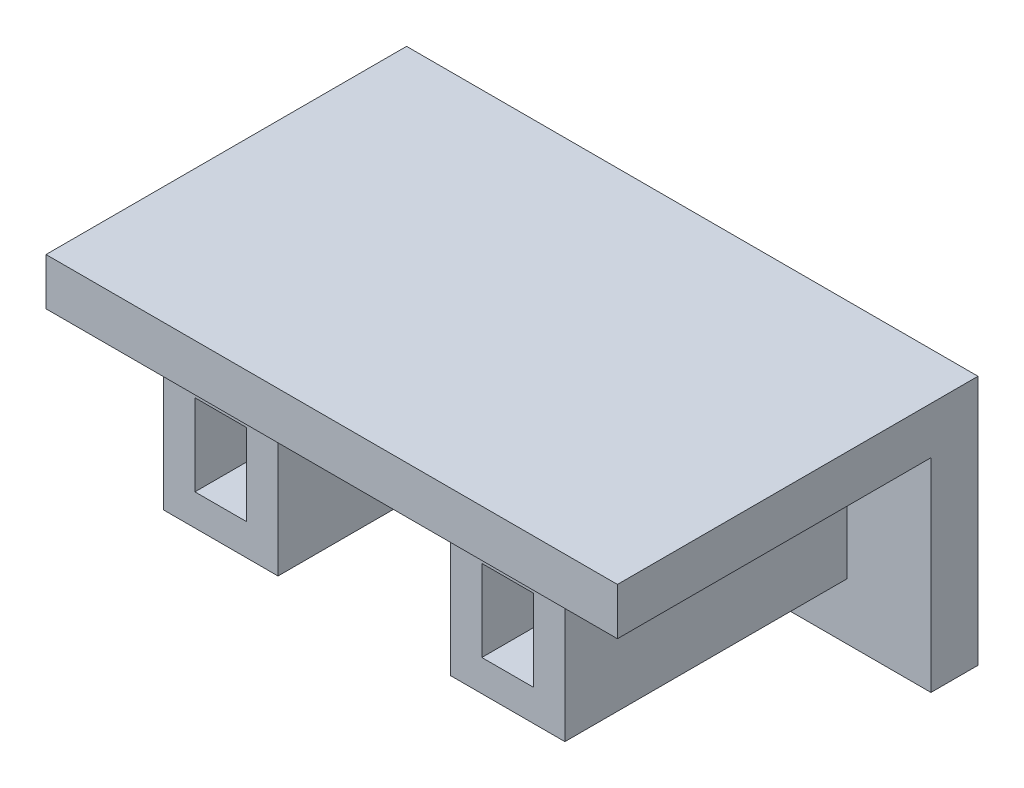
ISO-10303-21;
HEADER;
FILE_DESCRIPTION(('STEP AP214'),'2;1');
FILE_NAME('part.step','',(''),(''),'','','');
FILE_SCHEMA(('AUTOMOTIVE_DESIGN { 1 0 10303 214 1 1 1 1 }'));
ENDSEC;
DATA;
#1=APPLICATION_CONTEXT('core data for automotive mechanical design processes');
#2=APPLICATION_PROTOCOL_DEFINITION('international standard','automotive_design',2000,#1);
#3=PRODUCT_CONTEXT('',#1,'mechanical');
#4=PRODUCT('Part','Part','',(#3));
#5=PRODUCT_RELATED_PRODUCT_CATEGORY('part','',(#4));
#6=PRODUCT_DEFINITION_FORMATION('','',#4);
#7=PRODUCT_DEFINITION_CONTEXT('part definition',#1,'design');
#8=PRODUCT_DEFINITION('design','',#6,#7);
#9=PRODUCT_DEFINITION_SHAPE('','',#8);
#10=(LENGTH_UNIT() NAMED_UNIT(*) SI_UNIT(.MILLI.,.METRE.));
#11=(NAMED_UNIT(*) PLANE_ANGLE_UNIT() SI_UNIT($,.RADIAN.));
#12=(NAMED_UNIT(*) SI_UNIT($,.STERADIAN.) SOLID_ANGLE_UNIT());
#13=UNCERTAINTY_MEASURE_WITH_UNIT(LENGTH_MEASURE(1.E-05),#10,'distance_accuracy_value','');
#14=(GEOMETRIC_REPRESENTATION_CONTEXT(3) GLOBAL_UNCERTAINTY_ASSIGNED_CONTEXT((#13)) GLOBAL_UNIT_ASSIGNED_CONTEXT((#10,
#11,#12)) REPRESENTATION_CONTEXT('',''));
#15=CARTESIAN_POINT('',(0.,0.,0.));
#16=DIRECTION('',(0.,0.,1.));
#17=DIRECTION('',(1.,0.,0.));
#18=AXIS2_PLACEMENT_3D('',#15,#16,#17);
#19=CARTESIAN_POINT('',(0.,0.,3.));
#20=DIRECTION('',(0.,0.,1.));
#21=DIRECTION('',(1.,0.,0.));
#22=AXIS2_PLACEMENT_3D('',#19,#20,#21);
#23=PLANE('',#22);
#24=DIRECTION('',(-1.,0.,0.));
#25=VECTOR('',#24,1.);
#26=CARTESIAN_POINT('',(0.,-7.27084691116476,3.));
#27=LINE('',#26,#25);
#28=CARTESIAN_POINT('',(33.790968827961,-7.27084691116476,3.00000000000001));
#29=VERTEX_POINT('',#28);
#30=CARTESIAN_POINT('',(-2.65903117203897,-7.27084691116476,3.00000000000001));
#31=VERTEX_POINT('',#30);
#32=EDGE_CURVE('E268',#29,#31,#27,.T.);
#33=ORIENTED_EDGE('',*,*,#32,.F.);
#34=DIRECTION('',(0.,1.,0.));
#35=VECTOR('',#34,1.);
#36=CARTESIAN_POINT('',(33.790968827961,8.69796045063011,3.));
#37=LINE('',#36,#35);
#38=CARTESIAN_POINT('',(33.790968827961,5.69796045063011,3.));
#39=VERTEX_POINT('',#38);
#40=EDGE_CURVE('E191',#29,#39,#37,.T.);
#41=ORIENTED_EDGE('',*,*,#40,.T.);
#42=DIRECTION('',(1.,0.,0.));
#43=VECTOR('',#42,1.);
#44=CARTESIAN_POINT('',(-2.65903117203898,5.69796045063011,3.));
#45=LINE('',#44,#43);
#46=CARTESIAN_POINT('',(28.440968827961,5.69796045063011,3.));
#47=VERTEX_POINT('',#46);
#48=EDGE_CURVE('E266',#47,#39,#45,.T.);
#49=ORIENTED_EDGE('',*,*,#48,.F.);
#50=DIRECTION('',(0.,1.,0.));
#51=VECTOR('',#50,1.);
#52=CARTESIAN_POINT('',(28.440968827961,5.69796045063011,3.));
#53=LINE('',#52,#51);
#54=CARTESIAN_POINT('',(28.440968827961,-3.6632172456308,3.));
#55=VERTEX_POINT('',#54);
#56=EDGE_CURVE('E343',#55,#47,#53,.T.);
#57=ORIENTED_EDGE('',*,*,#56,.F.);
#58=DIRECTION('',(1.,0.,0.));
#59=VECTOR('',#58,1.);
#60=CARTESIAN_POINT('',(21.140968827961,-3.6632172456308,3.));
#61=LINE('',#60,#59);
#62=CARTESIAN_POINT('',(21.140968827961,-3.6632172456308,3.));
#63=VERTEX_POINT('',#62);
#64=EDGE_CURVE('E54',#63,#55,#61,.T.);
#65=ORIENTED_EDGE('',*,*,#64,.F.);
#66=DIRECTION('',(0.,-1.,0.));
#67=VECTOR('',#66,1.);
#68=CARTESIAN_POINT('',(21.140968827961,5.69796045063011,3.));
#69=LINE('',#68,#67);
#70=CARTESIAN_POINT('',(21.140968827961,5.69796045063011,3.));
#71=VERTEX_POINT('',#70);
#72=EDGE_CURVE('E347',#71,#63,#69,.T.);
#73=ORIENTED_EDGE('',*,*,#72,.F.);
#74=CARTESIAN_POINT('',(10.140968827961,5.69796045063011,3.));
#75=VERTEX_POINT('',#74);
#76=EDGE_CURVE('E276',#75,#71,#45,.T.);
#77=ORIENTED_EDGE('',*,*,#76,.F.);
#78=DIRECTION('',(0.,1.,0.));
#79=VECTOR('',#78,1.);
#80=CARTESIAN_POINT('',(10.140968827961,5.69796045063011,3.));
#81=LINE('',#80,#79);
#82=CARTESIAN_POINT('',(10.140968827961,-3.66321724563081,3.));
#83=VERTEX_POINT('',#82);
#84=EDGE_CURVE('E305',#83,#75,#81,.T.);
#85=ORIENTED_EDGE('',*,*,#84,.F.);
#86=DIRECTION('',(1.,0.,0.));
#87=VECTOR('',#86,1.);
#88=CARTESIAN_POINT('',(2.84096882796102,-3.66321724563081,3.));
#89=LINE('',#88,#87);
#90=CARTESIAN_POINT('',(2.84096882796102,-3.66321724563081,3.));
#91=VERTEX_POINT('',#90);
#92=EDGE_CURVE('E309',#91,#83,#89,.T.);
#93=ORIENTED_EDGE('',*,*,#92,.F.);
#94=DIRECTION('',(0.,-1.,0.));
#95=VECTOR('',#94,1.);
#96=CARTESIAN_POINT('',(2.84096882796102,5.69796045063011,3.));
#97=LINE('',#96,#95);
#98=CARTESIAN_POINT('',(2.84096882796102,5.69796045063011,3.));
#99=VERTEX_POINT('',#98);
#100=EDGE_CURVE('E312',#99,#91,#97,.T.);
#101=ORIENTED_EDGE('',*,*,#100,.F.);
#102=CARTESIAN_POINT('',(-2.65903117203898,5.69796045063011,3.));
#103=VERTEX_POINT('',#102);
#104=EDGE_CURVE('E279',#103,#99,#45,.T.);
#105=ORIENTED_EDGE('',*,*,#104,.F.);
#106=DIRECTION('',(0.,-1.,0.));
#107=VECTOR('',#106,1.);
#108=CARTESIAN_POINT('',(-2.65903117203898,8.69796045063011,3.));
#109=LINE('',#108,#107);
#110=EDGE_CURVE('E198',#103,#31,#109,.T.);
#111=ORIENTED_EDGE('',*,*,#110,.T.);
#112=EDGE_LOOP('',(#33,#41,#49,#57,#65,#73,#77,#85,#93,#101,#105,#111));
#113=FACE_BOUND('',#112,.T.);
#114=ADVANCED_FACE('F32',(#113),#23,.T.);
#115=CARTESIAN_POINT('',(-2.65903117203898,5.69796045063011,23.));
#116=DIRECTION('',(0.,1.,0.));
#117=DIRECTION('',(-1.,0.,0.));
#118=AXIS2_PLACEMENT_3D('',#115,#116,#117);
#119=PLANE('',#118);
#120=DIRECTION('',(0.,0.,-1.));
#121=VECTOR('',#120,1.);
#122=CARTESIAN_POINT('',(21.140968827961,5.69796045063011,21.));
#123=LINE('',#122,#121);
#124=CARTESIAN_POINT('',(21.140968827961,5.69796045063011,21.));
#125=VERTEX_POINT('',#124);
#126=EDGE_CURVE('E339',#125,#71,#123,.T.);
#127=ORIENTED_EDGE('',*,*,#126,.F.);
#128=DIRECTION('',(-1.,0.,0.));
#129=VECTOR('',#128,1.);
#130=CARTESIAN_POINT('',(21.140968827961,5.69796045063011,21.));
#131=LINE('',#130,#129);
#132=CARTESIAN_POINT('',(28.440968827961,5.69796045063011,21.));
#133=VERTEX_POINT('',#132);
#134=EDGE_CURVE('E342',#133,#125,#131,.T.);
#135=ORIENTED_EDGE('',*,*,#134,.F.);
#136=DIRECTION('',(0.,0.,-1.));
#137=VECTOR('',#136,1.);
#138=CARTESIAN_POINT('',(28.440968827961,5.69796045063011,21.));
#139=LINE('',#138,#137);
#140=EDGE_CURVE('E275',#133,#47,#139,.T.);
#141=ORIENTED_EDGE('',*,*,#140,.T.);
#142=ORIENTED_EDGE('',*,*,#48,.T.);
#143=DIRECTION('',(0.,0.,-1.));
#144=VECTOR('',#143,1.);
#145=CARTESIAN_POINT('',(33.790968827961,5.69796045063011,23.));
#146=LINE('',#145,#144);
#147=CARTESIAN_POINT('',(33.790968827961,5.69796045063011,23.));
#148=VERTEX_POINT('',#147);
#149=EDGE_CURVE('E272',#148,#39,#146,.T.);
#150=ORIENTED_EDGE('',*,*,#149,.F.);
#151=DIRECTION('',(1.,0.,0.));
#152=VECTOR('',#151,1.);
#153=CARTESIAN_POINT('',(-2.65903117203898,5.69796045063011,23.));
#154=LINE('',#153,#152);
#155=CARTESIAN_POINT('',(-2.65903117203898,5.69796045063011,23.));
#156=VERTEX_POINT('',#155);
#157=EDGE_CURVE('E290',#156,#148,#154,.T.);
#158=ORIENTED_EDGE('',*,*,#157,.F.);
#159=DIRECTION('',(0.,0.,-1.));
#160=VECTOR('',#159,1.);
#161=CARTESIAN_POINT('',(-2.65903117203898,5.69796045063011,23.));
#162=LINE('',#161,#160);
#163=EDGE_CURVE('E250',#156,#103,#162,.T.);
#164=ORIENTED_EDGE('',*,*,#163,.T.);
#165=ORIENTED_EDGE('',*,*,#104,.T.);
#166=DIRECTION('',(0.,0.,-1.));
#167=VECTOR('',#166,1.);
#168=CARTESIAN_POINT('',(2.84096882796102,5.69796045063011,21.));
#169=LINE('',#168,#167);
#170=CARTESIAN_POINT('',(2.84096882796102,5.69796045063011,21.));
#171=VERTEX_POINT('',#170);
#172=EDGE_CURVE('E301',#171,#99,#169,.T.);
#173=ORIENTED_EDGE('',*,*,#172,.F.);
#174=DIRECTION('',(-1.,0.,0.));
#175=VECTOR('',#174,1.);
#176=CARTESIAN_POINT('',(2.84096882796102,5.69796045063011,21.));
#177=LINE('',#176,#175);
#178=CARTESIAN_POINT('',(10.140968827961,5.69796045063011,21.));
#179=VERTEX_POINT('',#178);
#180=EDGE_CURVE('E304',#179,#171,#177,.T.);
#181=ORIENTED_EDGE('',*,*,#180,.F.);
#182=DIRECTION('',(0.,0.,-1.));
#183=VECTOR('',#182,1.);
#184=CARTESIAN_POINT('',(10.140968827961,5.69796045063011,21.));
#185=LINE('',#184,#183);
#186=EDGE_CURVE('E299',#179,#75,#185,.T.);
#187=ORIENTED_EDGE('',*,*,#186,.T.);
#188=ORIENTED_EDGE('',*,*,#76,.T.);
#189=EDGE_LOOP('',(#127,#135,#141,#142,#150,#158,#164,#165,#173,#181,#187,#188));
#190=FACE_BOUND('',#189,.T.);
#191=ADVANCED_FACE('F271',(#190),#119,.F.);
#192=CARTESIAN_POINT('',(-2.65903117203898,8.69796045063011,3.));
#193=DIRECTION('',(1.,0.,0.));
#194=DIRECTION('',(0.,1.,0.));
#195=AXIS2_PLACEMENT_3D('',#192,#193,#194);
#196=PLANE('',#195);
#197=DIRECTION('',(0.,-1.,0.));
#198=VECTOR('',#197,1.);
#199=CARTESIAN_POINT('',(-2.65903117203898,8.69796045063011,0.));
#200=LINE('',#199,#198);
#201=CARTESIAN_POINT('',(-2.65903117203898,8.69796045063011,0.));
#202=VERTEX_POINT('',#201);
#203=CARTESIAN_POINT('',(-2.65903117203897,-7.27084691116476,0.));
#204=VERTEX_POINT('',#203);
#205=EDGE_CURVE('E196',#202,#204,#200,.T.);
#206=ORIENTED_EDGE('',*,*,#205,.T.);
#207=DIRECTION('',(0.,0.,1.));
#208=VECTOR('',#207,1.);
#209=CARTESIAN_POINT('',(-2.65903117203897,-7.27084691116476,24.5138433934374));
#210=LINE('',#209,#208);
#211=EDGE_CURVE('E47',#204,#31,#210,.T.);
#212=ORIENTED_EDGE('',*,*,#211,.T.);
#213=ORIENTED_EDGE('',*,*,#110,.F.);
#214=ORIENTED_EDGE('',*,*,#163,.F.);
#215=DIRECTION('',(0.,-1.,0.));
#216=VECTOR('',#215,1.);
#217=CARTESIAN_POINT('',(-2.65903117203898,5.69796045063011,23.));
#218=LINE('',#217,#216);
#219=CARTESIAN_POINT('',(-2.65903117203898,8.69796045063011,23.));
#220=VERTEX_POINT('',#219);
#221=EDGE_CURVE('E287',#220,#156,#218,.T.);
#222=ORIENTED_EDGE('',*,*,#221,.F.);
#223=DIRECTION('',(0.,0.,-1.));
#224=VECTOR('',#223,1.);
#225=CARTESIAN_POINT('',(-2.65903117203898,8.69796045063011,3.));
#226=LINE('',#225,#224);
#227=EDGE_CURVE('E204',#220,#202,#226,.T.);
#228=ORIENTED_EDGE('',*,*,#227,.T.);
#229=EDGE_LOOP('',(#206,#212,#213,#214,#222,#228));
#230=FACE_BOUND('',#229,.T.);
#231=ADVANCED_FACE('F34',(#230),#196,.F.);
#232=CARTESIAN_POINT('',(33.790968827961,8.69796045063011,3.));
#233=DIRECTION('',(-1.,0.,0.));
#234=DIRECTION('',(0.,0.,1.));
#235=AXIS2_PLACEMENT_3D('',#232,#233,#234);
#236=PLANE('',#235);
#237=ORIENTED_EDGE('',*,*,#40,.F.);
#238=DIRECTION('',(0.,0.,1.));
#239=VECTOR('',#238,1.);
#240=CARTESIAN_POINT('',(33.790968827961,-7.27084691116476,24.5138433934374));
#241=LINE('',#240,#239);
#242=CARTESIAN_POINT('',(33.790968827961,-7.27084691116476,0.));
#243=VERTEX_POINT('',#242);
#244=EDGE_CURVE('E179',#243,#29,#241,.T.);
#245=ORIENTED_EDGE('',*,*,#244,.F.);
#246=DIRECTION('',(0.,1.,0.));
#247=VECTOR('',#246,1.);
#248=CARTESIAN_POINT('',(33.790968827961,8.69796045063011,0.));
#249=LINE('',#248,#247);
#250=CARTESIAN_POINT('',(33.790968827961,8.69796045063011,0.));
#251=VERTEX_POINT('',#250);
#252=EDGE_CURVE('E188',#243,#251,#249,.T.);
#253=ORIENTED_EDGE('',*,*,#252,.T.);
#254=DIRECTION('',(0.,0.,-1.));
#255=VECTOR('',#254,1.);
#256=CARTESIAN_POINT('',(33.790968827961,8.69796045063011,3.));
#257=LINE('',#256,#255);
#258=CARTESIAN_POINT('',(33.790968827961,8.69796045063011,23.));
#259=VERTEX_POINT('',#258);
#260=EDGE_CURVE('E207',#259,#251,#257,.T.);
#261=ORIENTED_EDGE('',*,*,#260,.F.);
#262=DIRECTION('',(0.,1.,0.));
#263=VECTOR('',#262,1.);
#264=CARTESIAN_POINT('',(33.790968827961,8.69796045063011,23.));
#265=LINE('',#264,#263);
#266=EDGE_CURVE('E281',#148,#259,#265,.T.);
#267=ORIENTED_EDGE('',*,*,#266,.F.);
#268=ORIENTED_EDGE('',*,*,#149,.T.);
#269=EDGE_LOOP('',(#237,#245,#253,#261,#267,#268));
#270=FACE_BOUND('',#269,.T.);
#271=ADVANCED_FACE('F187',(#270),#236,.F.);
#272=CARTESIAN_POINT('',(-2.65903117203898,8.69796045063011,3.));
#273=DIRECTION('',(0.,-1.,0.));
#274=DIRECTION('',(0.,0.,-1.));
#275=AXIS2_PLACEMENT_3D('',#272,#273,#274);
#276=PLANE('',#275);
#277=DIRECTION('',(-1.,0.,0.));
#278=VECTOR('',#277,1.);
#279=CARTESIAN_POINT('',(-2.65903117203898,8.69796045063011,0.));
#280=LINE('',#279,#278);
#281=EDGE_CURVE('E195',#251,#202,#280,.T.);
#282=ORIENTED_EDGE('',*,*,#281,.T.);
#283=ORIENTED_EDGE('',*,*,#227,.F.);
#284=DIRECTION('',(-1.,0.,0.));
#285=VECTOR('',#284,1.);
#286=CARTESIAN_POINT('',(-2.65903117203898,8.69796045063011,23.));
#287=LINE('',#286,#285);
#288=EDGE_CURVE('E282',#259,#220,#287,.T.);
#289=ORIENTED_EDGE('',*,*,#288,.F.);
#290=ORIENTED_EDGE('',*,*,#260,.T.);
#291=EDGE_LOOP('',(#282,#283,#289,#290));
#292=FACE_BOUND('',#291,.T.);
#293=ADVANCED_FACE('F412',(#292),#276,.F.);
#294=CARTESIAN_POINT('',(0.,0.,0.));
#295=DIRECTION('',(0.,0.,1.));
#296=DIRECTION('',(1.,0.,0.));
#297=AXIS2_PLACEMENT_3D('',#294,#295,#296);
#298=PLANE('',#297);
#299=DIRECTION('',(-1.,0.,0.));
#300=VECTOR('',#299,1.);
#301=CARTESIAN_POINT('',(0.,3.53678275436919,0.));
#302=LINE('',#301,#300);
#303=CARTESIAN_POINT('',(8.14096882796103,3.53678275436919,0.));
#304=VERTEX_POINT('',#303);
#305=CARTESIAN_POINT('',(4.84096882796102,3.53678275436919,0.));
#306=VERTEX_POINT('',#305);
#307=EDGE_CURVE('E227',#304,#306,#302,.T.);
#308=ORIENTED_EDGE('',*,*,#307,.T.);
#309=DIRECTION('',(0.,-1.,0.));
#310=VECTOR('',#309,1.);
#311=CARTESIAN_POINT('',(4.84096882796102,0.,0.));
#312=LINE('',#311,#310);
#313=CARTESIAN_POINT('',(4.84096882796102,-1.66321724563081,0.));
#314=VERTEX_POINT('',#313);
#315=EDGE_CURVE('E40',#306,#314,#312,.T.);
#316=ORIENTED_EDGE('',*,*,#315,.T.);
#317=DIRECTION('',(1.,0.,0.));
#318=VECTOR('',#317,1.);
#319=CARTESIAN_POINT('',(0.,-1.66321724563081,0.));
#320=LINE('',#319,#318);
#321=CARTESIAN_POINT('',(8.14096882796103,-1.66321724563081,0.));
#322=VERTEX_POINT('',#321);
#323=EDGE_CURVE('E221',#314,#322,#320,.T.);
#324=ORIENTED_EDGE('',*,*,#323,.T.);
#325=DIRECTION('',(0.,1.,0.));
#326=VECTOR('',#325,1.);
#327=CARTESIAN_POINT('',(8.14096882796103,0.,0.));
#328=LINE('',#327,#326);
#329=EDGE_CURVE('E224',#322,#304,#328,.T.);
#330=ORIENTED_EDGE('',*,*,#329,.T.);
#331=EDGE_LOOP('',(#308,#316,#324,#330));
#332=FACE_BOUND('',#331,.T.);
#333=DIRECTION('',(-1.,0.,0.));
#334=VECTOR('',#333,1.);
#335=CARTESIAN_POINT('',(0.,3.5367827543692,0.));
#336=LINE('',#335,#334);
#337=CARTESIAN_POINT('',(26.440968827961,3.5367827543692,0.));
#338=VERTEX_POINT('',#337);
#339=CARTESIAN_POINT('',(23.140968827961,3.5367827543692,0.));
#340=VERTEX_POINT('',#339);
#341=EDGE_CURVE('E215',#338,#340,#336,.T.);
#342=ORIENTED_EDGE('',*,*,#341,.T.);
#343=DIRECTION('',(0.,-1.,0.));
#344=VECTOR('',#343,1.);
#345=CARTESIAN_POINT('',(23.140968827961,0.,0.));
#346=LINE('',#345,#344);
#347=CARTESIAN_POINT('',(23.140968827961,-1.6632172456308,0.));
#348=VERTEX_POINT('',#347);
#349=EDGE_CURVE('E218',#340,#348,#346,.T.);
#350=ORIENTED_EDGE('',*,*,#349,.T.);
#351=DIRECTION('',(1.,0.,0.));
#352=VECTOR('',#351,1.);
#353=CARTESIAN_POINT('',(0.,-1.6632172456308,0.));
#354=LINE('',#353,#352);
#355=CARTESIAN_POINT('',(26.440968827961,-1.6632172456308,0.));
#356=VERTEX_POINT('',#355);
#357=EDGE_CURVE('E209',#348,#356,#354,.T.);
#358=ORIENTED_EDGE('',*,*,#357,.T.);
#359=DIRECTION('',(0.,1.,0.));
#360=VECTOR('',#359,1.);
#361=CARTESIAN_POINT('',(26.440968827961,0.,0.));
#362=LINE('',#361,#360);
#363=EDGE_CURVE('E212',#356,#338,#362,.T.);
#364=ORIENTED_EDGE('',*,*,#363,.T.);
#365=EDGE_LOOP('',(#342,#350,#358,#364));
#366=FACE_BOUND('',#365,.T.);
#367=ORIENTED_EDGE('',*,*,#252,.F.);
#368=DIRECTION('',(-1.,0.,0.));
#369=VECTOR('',#368,1.);
#370=CARTESIAN_POINT('',(0.,-7.27084691116476,0.));
#371=LINE('',#370,#369);
#372=EDGE_CURVE('E11',#243,#204,#371,.T.);
#373=ORIENTED_EDGE('',*,*,#372,.T.);
#374=ORIENTED_EDGE('',*,*,#205,.F.);
#375=ORIENTED_EDGE('',*,*,#281,.F.);
#376=EDGE_LOOP('',(#367,#373,#374,#375));
#377=FACE_BOUND('',#376,.T.);
#378=ADVANCED_FACE('F194',(#332,#366,#377),#298,.F.);
#379=CARTESIAN_POINT('',(23.140968827961,3.5367827543692,-17.8));
#380=DIRECTION('',(-1.,0.,0.));
#381=DIRECTION('',(0.,0.,1.));
#382=AXIS2_PLACEMENT_3D('',#379,#380,#381);
#383=PLANE('',#382);
#384=DIRECTION('',(0.,0.,1.));
#385=VECTOR('',#384,1.);
#386=CARTESIAN_POINT('',(23.140968827961,3.5367827543692,-17.8));
#387=LINE('',#386,#385);
#388=CARTESIAN_POINT('',(23.140968827961,3.5367827543692,21.));
#389=VERTEX_POINT('',#388);
#390=EDGE_CURVE('E255',#340,#389,#387,.T.);
#391=ORIENTED_EDGE('',*,*,#390,.T.);
#392=DIRECTION('',(0.,-1.,0.));
#393=VECTOR('',#392,1.);
#394=CARTESIAN_POINT('',(23.140968827961,3.5367827543692,21.));
#395=LINE('',#394,#393);
#396=CARTESIAN_POINT('',(23.140968827961,-1.6632172456308,21.));
#397=VERTEX_POINT('',#396);
#398=EDGE_CURVE('E368',#389,#397,#395,.T.);
#399=ORIENTED_EDGE('',*,*,#398,.T.);
#400=DIRECTION('',(0.,0.,1.));
#401=VECTOR('',#400,1.);
#402=CARTESIAN_POINT('',(23.140968827961,-1.6632172456308,-17.8));
#403=LINE('',#402,#401);
#404=EDGE_CURVE('E261',#348,#397,#403,.T.);
#405=ORIENTED_EDGE('',*,*,#404,.F.);
#406=ORIENTED_EDGE('',*,*,#349,.F.);
#407=EDGE_LOOP('',(#391,#399,#405,#406));
#408=FACE_BOUND('',#407,.T.);
#409=ADVANCED_FACE('F408',(#408),#383,.F.);
#410=CARTESIAN_POINT('',(23.140968827961,3.5367827543692,-17.8));
#411=DIRECTION('',(0.,1.,0.));
#412=DIRECTION('',(-1.,0.,0.));
#413=AXIS2_PLACEMENT_3D('',#410,#411,#412);
#414=PLANE('',#413);
#415=DIRECTION('',(0.,0.,1.));
#416=VECTOR('',#415,1.);
#417=CARTESIAN_POINT('',(26.440968827961,3.5367827543692,-17.8));
#418=LINE('',#417,#416);
#419=CARTESIAN_POINT('',(26.440968827961,3.5367827543692,21.));
#420=VERTEX_POINT('',#419);
#421=EDGE_CURVE('E257',#338,#420,#418,.T.);
#422=ORIENTED_EDGE('',*,*,#421,.T.);
#423=DIRECTION('',(-1.,0.,0.));
#424=VECTOR('',#423,1.);
#425=CARTESIAN_POINT('',(23.140968827961,3.5367827543692,21.));
#426=LINE('',#425,#424);
#427=EDGE_CURVE('E350',#420,#389,#426,.T.);
#428=ORIENTED_EDGE('',*,*,#427,.T.);
#429=ORIENTED_EDGE('',*,*,#390,.F.);
#430=ORIENTED_EDGE('',*,*,#341,.F.);
#431=EDGE_LOOP('',(#422,#428,#429,#430));
#432=FACE_BOUND('',#431,.T.);
#433=ADVANCED_FACE('F441',(#432),#414,.F.);
#434=CARTESIAN_POINT('',(26.440968827961,3.5367827543692,-17.8));
#435=DIRECTION('',(1.,0.,0.));
#436=DIRECTION('',(0.,0.,-1.));
#437=AXIS2_PLACEMENT_3D('',#434,#435,#436);
#438=PLANE('',#437);
#439=DIRECTION('',(0.,0.,1.));
#440=VECTOR('',#439,1.);
#441=CARTESIAN_POINT('',(26.440968827961,-1.6632172456308,-17.8));
#442=LINE('',#441,#440);
#443=CARTESIAN_POINT('',(26.440968827961,-1.6632172456308,21.));
#444=VERTEX_POINT('',#443);
#445=EDGE_CURVE('E259',#356,#444,#442,.T.);
#446=ORIENTED_EDGE('',*,*,#445,.T.);
#447=DIRECTION('',(0.,1.,0.));
#448=VECTOR('',#447,1.);
#449=CARTESIAN_POINT('',(26.440968827961,3.5367827543692,21.));
#450=LINE('',#449,#448);
#451=EDGE_CURVE('E362',#444,#420,#450,.T.);
#452=ORIENTED_EDGE('',*,*,#451,.T.);
#453=ORIENTED_EDGE('',*,*,#421,.F.);
#454=ORIENTED_EDGE('',*,*,#363,.F.);
#455=EDGE_LOOP('',(#446,#452,#453,#454));
#456=FACE_BOUND('',#455,.T.);
#457=ADVANCED_FACE('F451',(#456),#438,.F.);
#458=CARTESIAN_POINT('',(23.140968827961,-1.6632172456308,-17.8));
#459=DIRECTION('',(0.,-1.,0.));
#460=DIRECTION('',(0.,0.,-1.));
#461=AXIS2_PLACEMENT_3D('',#458,#459,#460);
#462=PLANE('',#461);
#463=ORIENTED_EDGE('',*,*,#404,.T.);
#464=DIRECTION('',(1.,0.,0.));
#465=VECTOR('',#464,1.);
#466=CARTESIAN_POINT('',(23.140968827961,-1.6632172456308,21.));
#467=LINE('',#466,#465);
#468=EDGE_CURVE('E365',#397,#444,#467,.T.);
#469=ORIENTED_EDGE('',*,*,#468,.T.);
#470=ORIENTED_EDGE('',*,*,#445,.F.);
#471=ORIENTED_EDGE('',*,*,#357,.F.);
#472=EDGE_LOOP('',(#463,#469,#470,#471));
#473=FACE_BOUND('',#472,.T.);
#474=ADVANCED_FACE('F462',(#473),#462,.F.);
#475=CARTESIAN_POINT('',(4.84096882796102,3.53678275436919,-17.8));
#476=DIRECTION('',(-1.,0.,0.));
#477=DIRECTION('',(0.,-1.,0.));
#478=AXIS2_PLACEMENT_3D('',#475,#476,#477);
#479=PLANE('',#478);
#480=DIRECTION('',(0.,0.,1.));
#481=VECTOR('',#480,1.);
#482=CARTESIAN_POINT('',(4.84096882796102,3.53678275436919,-17.8));
#483=LINE('',#482,#481);
#484=CARTESIAN_POINT('',(4.84096882796102,3.53678275436919,21.));
#485=VERTEX_POINT('',#484);
#486=EDGE_CURVE('E200',#306,#485,#483,.T.);
#487=ORIENTED_EDGE('',*,*,#486,.T.);
#488=DIRECTION('',(0.,-1.,0.));
#489=VECTOR('',#488,1.);
#490=CARTESIAN_POINT('',(4.84096882796102,3.53678275436919,21.));
#491=LINE('',#490,#489);
#492=CARTESIAN_POINT('',(4.84096882796102,-1.66321724563081,21.));
#493=VERTEX_POINT('',#492);
#494=EDGE_CURVE('E331',#485,#493,#491,.T.);
#495=ORIENTED_EDGE('',*,*,#494,.T.);
#496=DIRECTION('',(0.,0.,1.));
#497=VECTOR('',#496,1.);
#498=CARTESIAN_POINT('',(4.84096882796102,-1.66321724563081,-17.8));
#499=LINE('',#498,#497);
#500=EDGE_CURVE('E238',#314,#493,#499,.T.);
#501=ORIENTED_EDGE('',*,*,#500,.F.);
#502=ORIENTED_EDGE('',*,*,#315,.F.);
#503=EDGE_LOOP('',(#487,#495,#501,#502));
#504=FACE_BOUND('',#503,.T.);
#505=ADVANCED_FACE('F235',(#504),#479,.F.);
#506=CARTESIAN_POINT('',(4.84096882796102,3.53678275436919,-17.8));
#507=DIRECTION('',(0.,1.,0.));
#508=DIRECTION('',(-1.,0.,0.));
#509=AXIS2_PLACEMENT_3D('',#506,#507,#508);
#510=PLANE('',#509);
#511=DIRECTION('',(0.,0.,1.));
#512=VECTOR('',#511,1.);
#513=CARTESIAN_POINT('',(8.14096882796103,3.53678275436919,-17.8));
#514=LINE('',#513,#512);
#515=CARTESIAN_POINT('',(8.14096882796103,3.53678275436919,21.));
#516=VERTEX_POINT('',#515);
#517=EDGE_CURVE('E245',#304,#516,#514,.T.);
#518=ORIENTED_EDGE('',*,*,#517,.T.);
#519=DIRECTION('',(-1.,0.,0.));
#520=VECTOR('',#519,1.);
#521=CARTESIAN_POINT('',(4.84096882796102,3.53678275436919,21.));
#522=LINE('',#521,#520);
#523=EDGE_CURVE('E243',#516,#485,#522,.T.);
#524=ORIENTED_EDGE('',*,*,#523,.T.);
#525=ORIENTED_EDGE('',*,*,#486,.F.);
#526=ORIENTED_EDGE('',*,*,#307,.F.);
#527=EDGE_LOOP('',(#518,#524,#525,#526));
#528=FACE_BOUND('',#527,.T.);
#529=ADVANCED_FACE('F240',(#528),#510,.F.);
#530=CARTESIAN_POINT('',(8.14096882796103,3.53678275436919,-17.8));
#531=DIRECTION('',(1.,0.,0.));
#532=DIRECTION('',(0.,1.,0.));
#533=AXIS2_PLACEMENT_3D('',#530,#531,#532);
#534=PLANE('',#533);
#535=DIRECTION('',(0.,0.,1.));
#536=VECTOR('',#535,1.);
#537=CARTESIAN_POINT('',(8.14096882796103,-1.66321724563081,-17.8));
#538=LINE('',#537,#536);
#539=CARTESIAN_POINT('',(8.14096882796103,-1.66321724563081,21.));
#540=VERTEX_POINT('',#539);
#541=EDGE_CURVE('E247',#322,#540,#538,.T.);
#542=ORIENTED_EDGE('',*,*,#541,.T.);
#543=DIRECTION('',(0.,1.,0.));
#544=VECTOR('',#543,1.);
#545=CARTESIAN_POINT('',(8.14096882796103,3.53678275436919,21.));
#546=LINE('',#545,#544);
#547=EDGE_CURVE('E325',#540,#516,#546,.T.);
#548=ORIENTED_EDGE('',*,*,#547,.T.);
#549=ORIENTED_EDGE('',*,*,#517,.F.);
#550=ORIENTED_EDGE('',*,*,#329,.F.);
#551=EDGE_LOOP('',(#542,#548,#549,#550));
#552=FACE_BOUND('',#551,.T.);
#553=ADVANCED_FACE('F491',(#552),#534,.F.);
#554=CARTESIAN_POINT('',(4.84096882796102,-1.66321724563081,-17.8));
#555=DIRECTION('',(0.,-1.,0.));
#556=DIRECTION('',(0.,0.,-1.));
#557=AXIS2_PLACEMENT_3D('',#554,#555,#556);
#558=PLANE('',#557);
#559=ORIENTED_EDGE('',*,*,#500,.T.);
#560=DIRECTION('',(1.,0.,0.));
#561=VECTOR('',#560,1.);
#562=CARTESIAN_POINT('',(4.84096882796102,-1.66321724563081,21.));
#563=LINE('',#562,#561);
#564=EDGE_CURVE('E328',#493,#540,#563,.T.);
#565=ORIENTED_EDGE('',*,*,#564,.T.);
#566=ORIENTED_EDGE('',*,*,#541,.F.);
#567=ORIENTED_EDGE('',*,*,#323,.F.);
#568=EDGE_LOOP('',(#559,#565,#566,#567));
#569=FACE_BOUND('',#568,.T.);
#570=ADVANCED_FACE('F501',(#569),#558,.F.);
#571=CARTESIAN_POINT('',(0.,0.,23.));
#572=DIRECTION('',(0.,0.,-1.));
#573=DIRECTION('',(-1.,0.,0.));
#574=AXIS2_PLACEMENT_3D('',#571,#572,#573);
#575=PLANE('',#574);
#576=ORIENTED_EDGE('',*,*,#221,.T.);
#577=ORIENTED_EDGE('',*,*,#157,.T.);
#578=ORIENTED_EDGE('',*,*,#266,.T.);
#579=ORIENTED_EDGE('',*,*,#288,.T.);
#580=EDGE_LOOP('',(#576,#577,#578,#579));
#581=FACE_BOUND('',#580,.T.);
#582=ADVANCED_FACE('F433',(#581),#575,.F.);
#583=CARTESIAN_POINT('',(0.,0.,21.));
#584=DIRECTION('',(0.,0.,1.));
#585=DIRECTION('',(1.,0.,0.));
#586=AXIS2_PLACEMENT_3D('',#583,#584,#585);
#587=PLANE('',#586);
#588=DIRECTION('',(0.,-1.,0.));
#589=VECTOR('',#588,1.);
#590=CARTESIAN_POINT('',(2.84096882796102,5.69796045063011,21.));
#591=LINE('',#590,#589);
#592=CARTESIAN_POINT('',(2.84096882796102,-3.66321724563081,21.));
#593=VERTEX_POINT('',#592);
#594=EDGE_CURVE('E308',#171,#593,#591,.T.);
#595=ORIENTED_EDGE('',*,*,#594,.T.);
#596=DIRECTION('',(1.,0.,0.));
#597=VECTOR('',#596,1.);
#598=CARTESIAN_POINT('',(2.84096882796102,-3.66321724563081,21.));
#599=LINE('',#598,#597);
#600=CARTESIAN_POINT('',(10.140968827961,-3.66321724563081,21.));
#601=VERTEX_POINT('',#600);
#602=EDGE_CURVE('E320',#593,#601,#599,.T.);
#603=ORIENTED_EDGE('',*,*,#602,.T.);
#604=DIRECTION('',(0.,1.,0.));
#605=VECTOR('',#604,1.);
#606=CARTESIAN_POINT('',(10.140968827961,5.69796045063011,21.));
#607=LINE('',#606,#605);
#608=EDGE_CURVE('E317',#601,#179,#607,.T.);
#609=ORIENTED_EDGE('',*,*,#608,.T.);
#610=ORIENTED_EDGE('',*,*,#180,.T.);
#611=EDGE_LOOP('',(#595,#603,#609,#610));
#612=FACE_BOUND('',#611,.T.);
#613=ORIENTED_EDGE('',*,*,#564,.F.);
#614=ORIENTED_EDGE('',*,*,#494,.F.);
#615=ORIENTED_EDGE('',*,*,#523,.F.);
#616=ORIENTED_EDGE('',*,*,#547,.F.);
#617=EDGE_LOOP('',(#613,#614,#615,#616));
#618=FACE_BOUND('',#617,.T.);
#619=ADVANCED_FACE('F380',(#612,#618),#587,.T.);
#620=CARTESIAN_POINT('',(2.84096882796102,5.69796045063011,21.));
#621=DIRECTION('',(1.,0.,0.));
#622=DIRECTION('',(0.,1.,0.));
#623=AXIS2_PLACEMENT_3D('',#620,#621,#622);
#624=PLANE('',#623);
#625=ORIENTED_EDGE('',*,*,#100,.T.);
#626=DIRECTION('',(0.,0.,-1.));
#627=VECTOR('',#626,1.);
#628=CARTESIAN_POINT('',(2.84096882796102,-3.66321724563081,21.));
#629=LINE('',#628,#627);
#630=EDGE_CURVE('E277',#593,#91,#629,.T.);
#631=ORIENTED_EDGE('',*,*,#630,.F.);
#632=ORIENTED_EDGE('',*,*,#594,.F.);
#633=ORIENTED_EDGE('',*,*,#172,.T.);
#634=EDGE_LOOP('',(#625,#631,#632,#633));
#635=FACE_BOUND('',#634,.T.);
#636=ADVANCED_FACE('F377',(#635),#624,.F.);
#637=CARTESIAN_POINT('',(2.84096882796102,-3.66321724563081,21.));
#638=DIRECTION('',(0.,1.,0.));
#639=DIRECTION('',(0.,0.,1.));
#640=AXIS2_PLACEMENT_3D('',#637,#638,#639);
#641=PLANE('',#640);
#642=ORIENTED_EDGE('',*,*,#92,.T.);
#643=DIRECTION('',(0.,0.,-1.));
#644=VECTOR('',#643,1.);
#645=CARTESIAN_POINT('',(10.140968827961,-3.66321724563081,21.));
#646=LINE('',#645,#644);
#647=EDGE_CURVE('E296',#601,#83,#646,.T.);
#648=ORIENTED_EDGE('',*,*,#647,.F.);
#649=ORIENTED_EDGE('',*,*,#602,.F.);
#650=ORIENTED_EDGE('',*,*,#630,.T.);
#651=EDGE_LOOP('',(#642,#648,#649,#650));
#652=FACE_BOUND('',#651,.T.);
#653=ADVANCED_FACE('F390',(#652),#641,.F.);
#654=CARTESIAN_POINT('',(10.140968827961,5.69796045063011,21.));
#655=DIRECTION('',(-1.,0.,0.));
#656=DIRECTION('',(0.,0.,1.));
#657=AXIS2_PLACEMENT_3D('',#654,#655,#656);
#658=PLANE('',#657);
#659=ORIENTED_EDGE('',*,*,#84,.T.);
#660=ORIENTED_EDGE('',*,*,#186,.F.);
#661=ORIENTED_EDGE('',*,*,#608,.F.);
#662=ORIENTED_EDGE('',*,*,#647,.T.);
#663=EDGE_LOOP('',(#659,#660,#661,#662));
#664=FACE_BOUND('',#663,.T.);
#665=ADVANCED_FACE('F388',(#664),#658,.F.);
#666=CARTESIAN_POINT('',(0.,0.,21.));
#667=DIRECTION('',(0.,0.,1.));
#668=DIRECTION('',(1.,0.,0.));
#669=AXIS2_PLACEMENT_3D('',#666,#667,#668);
#670=PLANE('',#669);
#671=DIRECTION('',(0.,-1.,0.));
#672=VECTOR('',#671,1.);
#673=CARTESIAN_POINT('',(21.140968827961,5.69796045063011,21.));
#674=LINE('',#673,#672);
#675=CARTESIAN_POINT('',(21.140968827961,-3.6632172456308,21.));
#676=VERTEX_POINT('',#675);
#677=EDGE_CURVE('E345',#125,#676,#674,.T.);
#678=ORIENTED_EDGE('',*,*,#677,.T.);
#679=DIRECTION('',(1.,0.,0.));
#680=VECTOR('',#679,1.);
#681=CARTESIAN_POINT('',(21.140968827961,-3.6632172456308,21.));
#682=LINE('',#681,#680);
#683=CARTESIAN_POINT('',(28.440968827961,-3.6632172456308,21.));
#684=VERTEX_POINT('',#683);
#685=EDGE_CURVE('E356',#676,#684,#682,.T.);
#686=ORIENTED_EDGE('',*,*,#685,.T.);
#687=DIRECTION('',(0.,1.,0.));
#688=VECTOR('',#687,1.);
#689=CARTESIAN_POINT('',(28.440968827961,5.69796045063011,21.));
#690=LINE('',#689,#688);
#691=EDGE_CURVE('E353',#684,#133,#690,.T.);
#692=ORIENTED_EDGE('',*,*,#691,.T.);
#693=ORIENTED_EDGE('',*,*,#134,.T.);
#694=EDGE_LOOP('',(#678,#686,#692,#693));
#695=FACE_BOUND('',#694,.T.);
#696=ORIENTED_EDGE('',*,*,#468,.F.);
#697=ORIENTED_EDGE('',*,*,#398,.F.);
#698=ORIENTED_EDGE('',*,*,#427,.F.);
#699=ORIENTED_EDGE('',*,*,#451,.F.);
#700=EDGE_LOOP('',(#696,#697,#698,#699));
#701=FACE_BOUND('',#700,.T.);
#702=ADVANCED_FACE('F397',(#695,#701),#670,.T.);
#703=CARTESIAN_POINT('',(21.140968827961,5.69796045063011,21.));
#704=DIRECTION('',(1.,0.,0.));
#705=DIRECTION('',(0.,0.,-1.));
#706=AXIS2_PLACEMENT_3D('',#703,#704,#705);
#707=PLANE('',#706);
#708=ORIENTED_EDGE('',*,*,#72,.T.);
#709=DIRECTION('',(0.,0.,-1.));
#710=VECTOR('',#709,1.);
#711=CARTESIAN_POINT('',(21.140968827961,-3.6632172456308,21.));
#712=LINE('',#711,#710);
#713=EDGE_CURVE('E333',#676,#63,#712,.T.);
#714=ORIENTED_EDGE('',*,*,#713,.F.);
#715=ORIENTED_EDGE('',*,*,#677,.F.);
#716=ORIENTED_EDGE('',*,*,#126,.T.);
#717=EDGE_LOOP('',(#708,#714,#715,#716));
#718=FACE_BOUND('',#717,.T.);
#719=ADVANCED_FACE('F546',(#718),#707,.F.);
#720=CARTESIAN_POINT('',(21.140968827961,-3.6632172456308,21.));
#721=DIRECTION('',(0.,1.,0.));
#722=DIRECTION('',(0.,0.,1.));
#723=AXIS2_PLACEMENT_3D('',#720,#721,#722);
#724=PLANE('',#723);
#725=ORIENTED_EDGE('',*,*,#64,.T.);
#726=DIRECTION('',(0.,0.,-1.));
#727=VECTOR('',#726,1.);
#728=CARTESIAN_POINT('',(28.440968827961,-3.6632172456308,21.));
#729=LINE('',#728,#727);
#730=EDGE_CURVE('E335',#684,#55,#729,.T.);
#731=ORIENTED_EDGE('',*,*,#730,.F.);
#732=ORIENTED_EDGE('',*,*,#685,.F.);
#733=ORIENTED_EDGE('',*,*,#713,.T.);
#734=EDGE_LOOP('',(#725,#731,#732,#733));
#735=FACE_BOUND('',#734,.T.);
#736=ADVANCED_FACE('F556',(#735),#724,.F.);
#737=CARTESIAN_POINT('',(28.440968827961,5.69796045063011,21.));
#738=DIRECTION('',(-1.,0.,0.));
#739=DIRECTION('',(0.,0.,1.));
#740=AXIS2_PLACEMENT_3D('',#737,#738,#739);
#741=PLANE('',#740);
#742=ORIENTED_EDGE('',*,*,#56,.T.);
#743=ORIENTED_EDGE('',*,*,#140,.F.);
#744=ORIENTED_EDGE('',*,*,#691,.F.);
#745=ORIENTED_EDGE('',*,*,#730,.T.);
#746=EDGE_LOOP('',(#742,#743,#744,#745));
#747=FACE_BOUND('',#746,.T.);
#748=ADVANCED_FACE('F566',(#747),#741,.F.);
#749=CARTESIAN_POINT('',(-2.65903117203897,-7.27084691116476,24.5138433934374));
#750=DIRECTION('',(0.,1.,0.));
#751=DIRECTION('',(0.,0.,1.));
#752=AXIS2_PLACEMENT_3D('',#749,#750,#751);
#753=PLANE('',#752);
#754=ORIENTED_EDGE('',*,*,#32,.T.);
#755=ORIENTED_EDGE('',*,*,#211,.F.);
#756=ORIENTED_EDGE('',*,*,#372,.F.);
#757=ORIENTED_EDGE('',*,*,#244,.T.);
#758=EDGE_LOOP('',(#754,#755,#756,#757));
#759=FACE_BOUND('',#758,.T.);
#760=ADVANCED_FACE('F178',(#759),#753,.F.);
#761=CLOSED_SHELL('',(#114,#191,#231,#271,#293,#378,#409,#433,#457,#474,#505,#529,#553,#570,
#582,#619,#636,#653,#665,#702,#719,#736,#748,#760));
#762=MANIFOLD_SOLID_BREP('B2',#761);
#763=ADVANCED_BREP_SHAPE_REPRESENTATION('',(#18,#762),#14);
#764=SHAPE_DEFINITION_REPRESENTATION(#9,#763);
ENDSEC;
END-ISO-10303-21;
